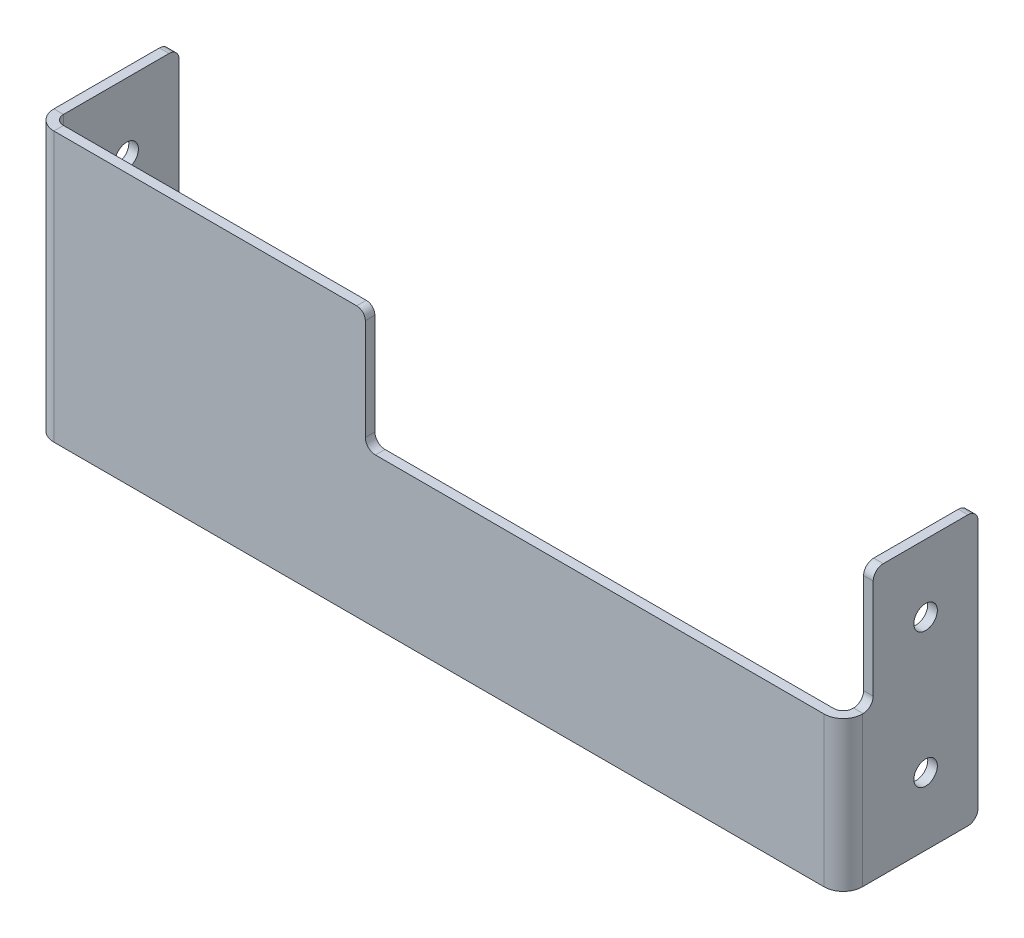
ISO-10303-21;
HEADER;
FILE_DESCRIPTION(('STEP AP214'),'2;1');
FILE_NAME('part.step','',(''),(''),'','','');
FILE_SCHEMA(('AUTOMOTIVE_DESIGN { 1 0 10303 214 1 1 1 1 }'));
ENDSEC;
DATA;
#1=APPLICATION_CONTEXT('core data for automotive mechanical design processes');
#2=APPLICATION_PROTOCOL_DEFINITION('international standard','automotive_design',2000,#1);
#3=PRODUCT_CONTEXT('',#1,'mechanical');
#4=PRODUCT('Part','Part','',(#3));
#5=PRODUCT_RELATED_PRODUCT_CATEGORY('part','',(#4));
#6=PRODUCT_DEFINITION_FORMATION('','',#4);
#7=PRODUCT_DEFINITION_CONTEXT('part definition',#1,'design');
#8=PRODUCT_DEFINITION('design','',#6,#7);
#9=PRODUCT_DEFINITION_SHAPE('','',#8);
#10=(LENGTH_UNIT() NAMED_UNIT(*) SI_UNIT(.MILLI.,.METRE.));
#11=(NAMED_UNIT(*) PLANE_ANGLE_UNIT() SI_UNIT($,.RADIAN.));
#12=(NAMED_UNIT(*) SI_UNIT($,.STERADIAN.) SOLID_ANGLE_UNIT());
#13=UNCERTAINTY_MEASURE_WITH_UNIT(LENGTH_MEASURE(1.E-05),#10,'distance_accuracy_value','');
#14=(GEOMETRIC_REPRESENTATION_CONTEXT(3) GLOBAL_UNCERTAINTY_ASSIGNED_CONTEXT((#13)) GLOBAL_UNIT_ASSIGNED_CONTEXT((#10,
#11,#12)) REPRESENTATION_CONTEXT('',''));
#15=CARTESIAN_POINT('',(0.,0.,0.));
#16=DIRECTION('',(0.,0.,1.));
#17=DIRECTION('',(1.,0.,0.));
#18=AXIS2_PLACEMENT_3D('',#15,#16,#17);
#19=CARTESIAN_POINT('',(-158.75,-25.5278986943512,16.7005000000141));
#20=DIRECTION('',(0.,-1.,0.));
#21=DIRECTION('',(0.,0.,-1.));
#22=AXIS2_PLACEMENT_3D('',#19,#20,#21);
#23=PLANE('',#22);
#24=DIRECTION('',(0.,0.,-1.));
#25=VECTOR('',#24,1.);
#26=CARTESIAN_POINT('',(-154.686,-25.5278986943512,16.7005000000141));
#27=LINE('',#26,#25);
#28=CARTESIAN_POINT('',(-154.686,-25.5278986943512,18.7325000000141));
#29=VERTEX_POINT('',#28);
#30=CARTESIAN_POINT('',(-154.686,-25.5278986943512,16.7005000000141));
#31=VERTEX_POINT('',#30);
#32=EDGE_CURVE('E288',#29,#31,#27,.T.);
#33=ORIENTED_EDGE('',*,*,#32,.T.);
#34=DIRECTION('',(-1.,0.,0.));
#35=VECTOR('',#34,1.);
#36=CARTESIAN_POINT('',(12.7,-25.5278986943512,16.7005000000141));
#37=LINE('',#36,#35);
#38=CARTESIAN_POINT('',(8.636,-25.5278986943512,16.7005000000141));
#39=VERTEX_POINT('',#38);
#40=EDGE_CURVE('E283',#39,#31,#37,.T.);
#41=ORIENTED_EDGE('',*,*,#40,.F.);
#42=DIRECTION('',(0.,0.,1.));
#43=VECTOR('',#42,1.);
#44=CARTESIAN_POINT('',(8.636,-25.5278986943512,16.7005000000141));
#45=LINE('',#44,#43);
#46=CARTESIAN_POINT('',(8.636,-25.5278986943512,18.7325000000141));
#47=VERTEX_POINT('',#46);
#48=EDGE_CURVE('E532',#39,#47,#45,.T.);
#49=ORIENTED_EDGE('',*,*,#48,.T.);
#50=DIRECTION('',(1.,0.,0.));
#51=VECTOR('',#50,1.);
#52=CARTESIAN_POINT('',(12.7,-25.5278986943512,18.7325000000141));
#53=LINE('',#52,#51);
#54=EDGE_CURVE('E348',#29,#47,#53,.T.);
#55=ORIENTED_EDGE('',*,*,#54,.F.);
#56=EDGE_LOOP('',(#33,#41,#49,#55));
#57=FACE_BOUND('',#56,.T.);
#58=ADVANCED_FACE('F50',(#57),#23,.T.);
#59=CARTESIAN_POINT('',(12.7,31.6221013056488,16.7005000000141));
#60=DIRECTION('',(0.,1.,0.));
#61=DIRECTION('',(1.,0.,0.));
#62=AXIS2_PLACEMENT_3D('',#59,#60,#61);
#63=PLANE('',#62);
#64=DIRECTION('',(-1.,0.,0.));
#65=VECTOR('',#64,1.);
#66=CARTESIAN_POINT('',(-158.75,31.6221013056488,18.7325000000141));
#67=LINE('',#66,#65);
#68=CARTESIAN_POINT('',(-90.469212,31.6221013056486,18.7325000000141));
#69=VERTEX_POINT('',#68);
#70=CARTESIAN_POINT('',(-154.686,31.6221013056488,18.7325000000141));
#71=VERTEX_POINT('',#70);
#72=EDGE_CURVE('E539',#69,#71,#67,.T.);
#73=ORIENTED_EDGE('',*,*,#72,.F.);
#74=DIRECTION('',(0.,0.,-1.));
#75=VECTOR('',#74,1.);
#76=CARTESIAN_POINT('',(-90.469212,31.6221013056486,57.5535238490692));
#77=LINE('',#76,#75);
#78=CARTESIAN_POINT('',(-90.469212,31.6221013056486,16.7005000000141));
#79=VERTEX_POINT('',#78);
#80=EDGE_CURVE('E227',#69,#79,#77,.T.);
#81=ORIENTED_EDGE('',*,*,#80,.T.);
#82=DIRECTION('',(1.,0.,0.));
#83=VECTOR('',#82,1.);
#84=CARTESIAN_POINT('',(-158.75,31.6221013056488,16.7005000000141));
#85=LINE('',#84,#83);
#86=CARTESIAN_POINT('',(-154.686,31.6221013056488,16.7005000000141));
#87=VERTEX_POINT('',#86);
#88=EDGE_CURVE('E562',#87,#79,#85,.T.);
#89=ORIENTED_EDGE('',*,*,#88,.F.);
#90=DIRECTION('',(0.,0.,1.));
#91=VECTOR('',#90,1.);
#92=CARTESIAN_POINT('',(-154.686,31.6221013056488,16.7005000000141));
#93=LINE('',#92,#91);
#94=EDGE_CURVE('E588',#87,#71,#93,.T.);
#95=ORIENTED_EDGE('',*,*,#94,.T.);
#96=EDGE_LOOP('',(#73,#81,#89,#95));
#97=FACE_BOUND('',#96,.T.);
#98=ADVANCED_FACE('F428',(#97),#63,.T.);
#99=CARTESIAN_POINT('',(12.7,3.0471013056488,4.7111378579681));
#100=DIRECTION('',(1.,0.,0.));
#101=DIRECTION('',(0.,0.,1.));
#102=AXIS2_PLACEMENT_3D('',#99,#100,#101);
#103=PLANE('',#102);
#104=CARTESIAN_POINT('',(12.7,17.3346013056489,1.2700000000141));
#105=DIRECTION('',(1.,0.,0.));
#106=DIRECTION('',(0.,0.,-1.));
#107=AXIS2_PLACEMENT_3D('',#104,#105,#106);
#108=CIRCLE('',#107,2.4892);
#109=CARTESIAN_POINT('',(12.7,17.3346013056489,-1.2191999999859));
#110=VERTEX_POINT('',#109);
#111=EDGE_CURVE('E246',#110,#110,#108,.T.);
#112=ORIENTED_EDGE('',*,*,#111,.F.);
#113=EDGE_LOOP('',(#112));
#114=FACE_BOUND('',#113,.T.);
#115=CARTESIAN_POINT('',(12.7,-11.2403986943513,1.2700000000141));
#116=DIRECTION('',(1.,0.,0.));
#117=DIRECTION('',(0.,0.,-1.));
#118=AXIS2_PLACEMENT_3D('',#115,#116,#117);
#119=CIRCLE('',#118,2.4892);
#120=CARTESIAN_POINT('',(12.7,-11.2403986943513,-1.2191999999859));
#121=VERTEX_POINT('',#120);
#122=EDGE_CURVE('E250',#121,#121,#119,.T.);
#123=ORIENTED_EDGE('',*,*,#122,.F.);
#124=EDGE_LOOP('',(#123));
#125=FACE_BOUND('',#124,.T.);
#126=DIRECTION('',(0.,0.,-1.));
#127=VECTOR('',#126,1.);
#128=CARTESIAN_POINT('',(12.7,-25.5278986943512,23.8610514318301));
#129=LINE('',#128,#127);
#130=CARTESIAN_POINT('',(12.7,-25.5278986943512,14.6685000000141));
#131=VERTEX_POINT('',#130);
#132=CARTESIAN_POINT('',(12.7,-25.5278986943512,-7.70737599998589));
#133=VERTEX_POINT('',#132);
#134=EDGE_CURVE('E534',#131,#133,#129,.T.);
#135=ORIENTED_EDGE('',*,*,#134,.T.);
#136=CARTESIAN_POINT('',(12.7,-23.3927746943512,-7.7073759999859));
#137=DIRECTION('',(1.,0.,0.));
#138=DIRECTION('',(0.,0.,-1.));
#139=AXIS2_PLACEMENT_3D('',#136,#137,#138);
#140=CIRCLE('',#139,2.135124);
#141=CARTESIAN_POINT('',(12.7,-23.3927746943512,-9.8424999999859));
#142=VERTEX_POINT('',#141);
#143=EDGE_CURVE('E377',#133,#142,#140,.T.);
#144=ORIENTED_EDGE('',*,*,#143,.T.);
#145=DIRECTION('',(0.,1.,0.));
#146=VECTOR('',#145,1.);
#147=CARTESIAN_POINT('',(12.7,31.6221013056488,-9.8424999999859));
#148=LINE('',#147,#146);
#149=CARTESIAN_POINT('',(12.7,29.4869773056488,-9.8424999999859));
#150=VERTEX_POINT('',#149);
#151=EDGE_CURVE('E294',#142,#150,#148,.T.);
#152=ORIENTED_EDGE('',*,*,#151,.T.);
#153=CARTESIAN_POINT('',(12.7,29.4869773056488,-7.7073759999859));
#154=DIRECTION('',(1.,0.,0.));
#155=DIRECTION('',(0.,0.,-1.));
#156=AXIS2_PLACEMENT_3D('',#153,#154,#155);
#157=CIRCLE('',#156,2.135124);
#158=CARTESIAN_POINT('',(12.7,31.6221013056488,-7.7073759999859));
#159=VERTEX_POINT('',#158);
#160=EDGE_CURVE('E375',#150,#159,#157,.T.);
#161=ORIENTED_EDGE('',*,*,#160,.T.);
#162=DIRECTION('',(0.,0.,1.));
#163=VECTOR('',#162,1.);
#164=CARTESIAN_POINT('',(12.7,31.6221013056488,14.6685000000141));
#165=LINE('',#164,#163);
#166=CARTESIAN_POINT('',(12.7,31.6221013056488,10.2473760000141));
#167=VERTEX_POINT('',#166);
#168=EDGE_CURVE('E290',#159,#167,#165,.T.);
#169=ORIENTED_EDGE('',*,*,#168,.T.);
#170=CARTESIAN_POINT('',(12.7,29.4869773056488,10.2473760000141));
#171=DIRECTION('',(1.,0.,0.));
#172=DIRECTION('',(0.,0.,-1.));
#173=AXIS2_PLACEMENT_3D('',#170,#171,#172);
#174=CIRCLE('',#173,2.135124);
#175=CARTESIAN_POINT('',(12.7,29.4869773056488,12.3825000000141));
#176=VERTEX_POINT('',#175);
#177=EDGE_CURVE('E373',#167,#176,#174,.T.);
#178=ORIENTED_EDGE('',*,*,#177,.T.);
#179=DIRECTION('',(0.,1.,0.));
#180=VECTOR('',#179,1.);
#181=CARTESIAN_POINT('',(12.7,31.6221013056488,12.3825000000141));
#182=LINE('',#181,#180);
#183=CARTESIAN_POINT('',(12.7,8.35722530564878,12.3825000000141));
#184=VERTEX_POINT('',#183);
#185=EDGE_CURVE('E271',#184,#176,#182,.T.);
#186=ORIENTED_EDGE('',*,*,#185,.F.);
#187=CARTESIAN_POINT('',(12.7,8.35722530564878,14.5176240000141));
#188=DIRECTION('',(1.,0.,0.));
#189=DIRECTION('',(0.,0.,-1.));
#190=AXIS2_PLACEMENT_3D('',#187,#188,#189);
#191=CIRCLE('',#190,2.135124);
#192=CARTESIAN_POINT('',(12.7,6.22210130564878,14.5176240000141));
#193=VERTEX_POINT('',#192);
#194=EDGE_CURVE('E59',#184,#193,#191,.F.);
#195=ORIENTED_EDGE('',*,*,#194,.T.);
#196=DIRECTION('',(0.,0.,-1.));
#197=VECTOR('',#196,1.);
#198=CARTESIAN_POINT('',(12.7,6.22210130564878,18.7325000000141));
#199=LINE('',#198,#197);
#200=CARTESIAN_POINT('',(12.7,6.22210130564878,14.6685000000141));
#201=VERTEX_POINT('',#200);
#202=EDGE_CURVE('E264',#201,#193,#199,.T.);
#203=ORIENTED_EDGE('',*,*,#202,.F.);
#204=DIRECTION('',(0.,-1.,0.));
#205=VECTOR('',#204,1.);
#206=CARTESIAN_POINT('',(12.7,3.0471013056488,14.6685000000141));
#207=LINE('',#206,#205);
#208=EDGE_CURVE('E564',#201,#131,#207,.T.);
#209=ORIENTED_EDGE('',*,*,#208,.T.);
#210=EDGE_LOOP('',(#135,#144,#152,#161,#169,#178,#186,#195,#203,#209));
#211=FACE_BOUND('',#210,.T.);
#212=ADVANCED_FACE('F435',(#114,#125,#211),#103,.T.);
#213=CARTESIAN_POINT('',(8.636,3.0471013056488,14.6685000000141));
#214=DIRECTION('',(0.,1.,0.));
#215=DIRECTION('',(0.,0.,1.));
#216=AXIS2_PLACEMENT_3D('',#213,#214,#215);
#217=CYLINDRICAL_SURFACE('',#216,2.032);
#218=DIRECTION('',(0.,-1.,0.));
#219=VECTOR('',#218,1.);
#220=CARTESIAN_POINT('',(8.636,17.3346013056488,16.7005000000141));
#221=LINE('',#220,#219);
#222=CARTESIAN_POINT('',(8.636,6.22210130564878,16.7005000000141));
#223=VERTEX_POINT('',#222);
#224=EDGE_CURVE('E281',#223,#39,#221,.T.);
#225=ORIENTED_EDGE('',*,*,#224,.F.);
#226=CARTESIAN_POINT('',(8.636,6.22210130564878,14.6685000000141));
#227=DIRECTION('',(0.,-1.,0.));
#228=DIRECTION('',(0.,0.,-1.));
#229=AXIS2_PLACEMENT_3D('',#226,#227,#228);
#230=CIRCLE('',#229,2.032);
#231=CARTESIAN_POINT('',(10.668,6.22210130564878,14.6685000000141));
#232=VERTEX_POINT('',#231);
#233=EDGE_CURVE('E267',#232,#223,#230,.T.);
#234=ORIENTED_EDGE('',*,*,#233,.F.);
#235=DIRECTION('',(0.,1.,0.));
#236=VECTOR('',#235,1.);
#237=CARTESIAN_POINT('',(10.668,3.0471013056488,14.6685000000141));
#238=LINE('',#237,#236);
#239=CARTESIAN_POINT('',(10.668,-25.5278986943512,14.6685000000141));
#240=VERTEX_POINT('',#239);
#241=EDGE_CURVE('E531',#240,#232,#238,.T.);
#242=ORIENTED_EDGE('',*,*,#241,.F.);
#243=CARTESIAN_POINT('',(8.636,-25.5278986943512,14.6685000000141));
#244=DIRECTION('',(0.,-1.,0.));
#245=DIRECTION('',(1.,0.,0.));
#246=AXIS2_PLACEMENT_3D('',#243,#244,#245);
#247=CIRCLE('',#246,2.032);
#248=EDGE_CURVE('E295',#240,#39,#247,.T.);
#249=ORIENTED_EDGE('',*,*,#248,.T.);
#250=EDGE_LOOP('',(#225,#234,#242,#249));
#251=FACE_BOUND('',#250,.T.);
#252=ADVANCED_FACE('F451',(#251),#217,.F.);
#253=CARTESIAN_POINT('',(10.668,-25.5278986943512,-9.8424999999859));
#254=DIRECTION('',(0.,0.,-1.));
#255=DIRECTION('',(0.,-1.,0.));
#256=AXIS2_PLACEMENT_3D('',#253,#254,#255);
#257=PLANE('',#256);
#258=ORIENTED_EDGE('',*,*,#151,.F.);
#259=DIRECTION('',(1.,0.,0.));
#260=VECTOR('',#259,1.);
#261=CARTESIAN_POINT('',(10.668,-23.3927746943512,-9.8424999999859));
#262=LINE('',#261,#260);
#263=CARTESIAN_POINT('',(10.668,-23.3927746943512,-9.8424999999859));
#264=VERTEX_POINT('',#263);
#265=EDGE_CURVE('E382',#142,#264,#262,.F.);
#266=ORIENTED_EDGE('',*,*,#265,.T.);
#267=DIRECTION('',(0.,-1.,0.));
#268=VECTOR('',#267,1.);
#269=CARTESIAN_POINT('',(10.668,31.6221013056488,-9.8424999999859));
#270=LINE('',#269,#268);
#271=CARTESIAN_POINT('',(10.668,29.4869773056488,-9.8424999999859));
#272=VERTEX_POINT('',#271);
#273=EDGE_CURVE('E530',#272,#264,#270,.T.);
#274=ORIENTED_EDGE('',*,*,#273,.F.);
#275=DIRECTION('',(1.,0.,0.));
#276=VECTOR('',#275,1.);
#277=CARTESIAN_POINT('',(10.668,29.4869773056488,-9.8424999999859));
#278=LINE('',#277,#276);
#279=EDGE_CURVE('E379',#272,#150,#278,.T.);
#280=ORIENTED_EDGE('',*,*,#279,.T.);
#281=EDGE_LOOP('',(#258,#266,#274,#280));
#282=FACE_BOUND('',#281,.T.);
#283=ADVANCED_FACE('F448',(#282),#257,.T.);
#284=CARTESIAN_POINT('',(10.668,31.6221013056488,-9.8424999999859));
#285=DIRECTION('',(0.,1.,0.));
#286=DIRECTION('',(1.,0.,0.));
#287=AXIS2_PLACEMENT_3D('',#284,#285,#286);
#288=PLANE('',#287);
#289=ORIENTED_EDGE('',*,*,#168,.F.);
#290=DIRECTION('',(1.,0.,0.));
#291=VECTOR('',#290,1.);
#292=CARTESIAN_POINT('',(10.668,31.6221013056488,-7.7073759999859));
#293=LINE('',#292,#291);
#294=CARTESIAN_POINT('',(10.668,31.6221013056488,-7.70737599998589));
#295=VERTEX_POINT('',#294);
#296=EDGE_CURVE('E393',#159,#295,#293,.F.);
#297=ORIENTED_EDGE('',*,*,#296,.T.);
#298=DIRECTION('',(0.,0.,1.));
#299=VECTOR('',#298,1.);
#300=CARTESIAN_POINT('',(10.668,31.6221013056488,23.8610514318301));
#301=LINE('',#300,#299);
#302=CARTESIAN_POINT('',(10.668,31.6221013056488,10.2473760000141));
#303=VERTEX_POINT('',#302);
#304=EDGE_CURVE('E526',#295,#303,#301,.T.);
#305=ORIENTED_EDGE('',*,*,#304,.T.);
#306=DIRECTION('',(1.,0.,0.));
#307=VECTOR('',#306,1.);
#308=CARTESIAN_POINT('',(12.7,31.6221013056488,10.2473760000141));
#309=LINE('',#308,#307);
#310=EDGE_CURVE('E390',#303,#167,#309,.T.);
#311=ORIENTED_EDGE('',*,*,#310,.T.);
#312=EDGE_LOOP('',(#289,#297,#305,#311));
#313=FACE_BOUND('',#312,.T.);
#314=ADVANCED_FACE('F446',(#313),#288,.T.);
#315=CARTESIAN_POINT('',(12.7,-25.5278986943512,14.6685000000141));
#316=DIRECTION('',(0.,-1.,0.));
#317=DIRECTION('',(0.,0.,-1.));
#318=AXIS2_PLACEMENT_3D('',#315,#316,#317);
#319=PLANE('',#318);
#320=DIRECTION('',(-1.,0.,0.));
#321=VECTOR('',#320,1.);
#322=CARTESIAN_POINT('',(11.11504,-25.5278986943512,14.6685000000141));
#323=LINE('',#322,#321);
#324=EDGE_CURVE('E339',#131,#240,#323,.T.);
#325=ORIENTED_EDGE('',*,*,#324,.F.);
#326=CARTESIAN_POINT('',(8.636,-25.5278986943512,14.6685000000141));
#327=DIRECTION('',(0.,1.,0.));
#328=DIRECTION('',(0.,0.,1.));
#329=AXIS2_PLACEMENT_3D('',#326,#327,#328);
#330=CIRCLE('',#329,4.064);
#331=EDGE_CURVE('E345',#47,#131,#330,.T.);
#332=ORIENTED_EDGE('',*,*,#331,.F.);
#333=ORIENTED_EDGE('',*,*,#48,.F.);
#334=ORIENTED_EDGE('',*,*,#248,.F.);
#335=EDGE_LOOP('',(#325,#332,#333,#334));
#336=FACE_BOUND('',#335,.T.);
#337=ADVANCED_FACE('F442',(#336),#319,.T.);
#338=CARTESIAN_POINT('',(10.668,3.0471013056488,4.7111378579681));
#339=DIRECTION('',(1.,0.,0.));
#340=DIRECTION('',(0.,1.,0.));
#341=AXIS2_PLACEMENT_3D('',#338,#339,#340);
#342=PLANE('',#341);
#343=CARTESIAN_POINT('',(10.668,17.3346013056489,1.2700000000141));
#344=DIRECTION('',(1.,0.,0.));
#345=DIRECTION('',(0.,1.,0.));
#346=AXIS2_PLACEMENT_3D('',#343,#344,#345);
#347=CIRCLE('',#346,2.4892);
#348=CARTESIAN_POINT('',(10.668,19.8238013056489,1.2700000000141));
#349=VERTEX_POINT('',#348);
#350=EDGE_CURVE('E261',#349,#349,#347,.T.);
#351=ORIENTED_EDGE('',*,*,#350,.T.);
#352=EDGE_LOOP('',(#351));
#353=FACE_BOUND('',#352,.T.);
#354=CARTESIAN_POINT('',(10.668,-11.2403986943513,1.2700000000141));
#355=DIRECTION('',(1.,0.,0.));
#356=DIRECTION('',(0.,1.,0.));
#357=AXIS2_PLACEMENT_3D('',#354,#355,#356);
#358=CIRCLE('',#357,2.4892);
#359=CARTESIAN_POINT('',(10.668,-8.75119869435134,1.2700000000141));
#360=VERTEX_POINT('',#359);
#361=EDGE_CURVE('E258',#360,#360,#358,.T.);
#362=ORIENTED_EDGE('',*,*,#361,.T.);
#363=EDGE_LOOP('',(#362));
#364=FACE_BOUND('',#363,.T.);
#365=ORIENTED_EDGE('',*,*,#273,.T.);
#366=CARTESIAN_POINT('',(10.668,-23.3927746943512,-7.7073759999859));
#367=DIRECTION('',(1.,0.,0.));
#368=DIRECTION('',(0.,1.,0.));
#369=AXIS2_PLACEMENT_3D('',#366,#367,#368);
#370=CIRCLE('',#369,2.135124);
#371=CARTESIAN_POINT('',(10.668,-25.5278986943512,-7.70737599998589));
#372=VERTEX_POINT('',#371);
#373=EDGE_CURVE('E388',#264,#372,#370,.F.);
#374=ORIENTED_EDGE('',*,*,#373,.T.);
#375=DIRECTION('',(0.,0.,1.));
#376=VECTOR('',#375,1.);
#377=CARTESIAN_POINT('',(10.668,-25.5278986943512,23.8610514318301));
#378=LINE('',#377,#376);
#379=EDGE_CURVE('E344',#372,#240,#378,.T.);
#380=ORIENTED_EDGE('',*,*,#379,.T.);
#381=ORIENTED_EDGE('',*,*,#241,.T.);
#382=DIRECTION('',(0.,0.,1.));
#383=VECTOR('',#382,1.);
#384=CARTESIAN_POINT('',(10.668,6.22210130564878,18.7325000000141));
#385=LINE('',#384,#383);
#386=CARTESIAN_POINT('',(10.668,6.22210130564878,14.5176240000141));
#387=VERTEX_POINT('',#386);
#388=EDGE_CURVE('E265',#387,#232,#385,.T.);
#389=ORIENTED_EDGE('',*,*,#388,.F.);
#390=CARTESIAN_POINT('',(10.668,8.35722530564878,14.5176240000141));
#391=DIRECTION('',(1.,0.,0.));
#392=DIRECTION('',(0.,1.,0.));
#393=AXIS2_PLACEMENT_3D('',#390,#391,#392);
#394=CIRCLE('',#393,2.135124);
#395=CARTESIAN_POINT('',(10.668,8.35722530564878,12.3825000000141));
#396=VERTEX_POINT('',#395);
#397=EDGE_CURVE('E12',#387,#396,#394,.T.);
#398=ORIENTED_EDGE('',*,*,#397,.T.);
#399=DIRECTION('',(0.,-1.,0.));
#400=VECTOR('',#399,1.);
#401=CARTESIAN_POINT('',(10.668,31.6221013056488,12.3825000000141));
#402=LINE('',#401,#400);
#403=CARTESIAN_POINT('',(10.668,29.4869773056488,12.3825000000141));
#404=VERTEX_POINT('',#403);
#405=EDGE_CURVE('E268',#404,#396,#402,.T.);
#406=ORIENTED_EDGE('',*,*,#405,.F.);
#407=CARTESIAN_POINT('',(10.668,29.4869773056488,10.2473760000141));
#408=DIRECTION('',(1.,0.,0.));
#409=DIRECTION('',(0.,1.,0.));
#410=AXIS2_PLACEMENT_3D('',#407,#408,#409);
#411=CIRCLE('',#410,2.135124);
#412=EDGE_CURVE('E384',#404,#303,#411,.F.);
#413=ORIENTED_EDGE('',*,*,#412,.T.);
#414=ORIENTED_EDGE('',*,*,#304,.F.);
#415=CARTESIAN_POINT('',(10.668,29.4869773056488,-7.7073759999859));
#416=DIRECTION('',(1.,0.,0.));
#417=DIRECTION('',(0.,1.,0.));
#418=AXIS2_PLACEMENT_3D('',#415,#416,#417);
#419=CIRCLE('',#418,2.135124);
#420=EDGE_CURVE('E386',#295,#272,#419,.F.);
#421=ORIENTED_EDGE('',*,*,#420,.T.);
#422=EDGE_LOOP('',(#365,#374,#380,#381,#389,#398,#406,#413,#414,#421));
#423=FACE_BOUND('',#422,.T.);
#424=ADVANCED_FACE('F445',(#353,#364,#423),#342,.F.);
#425=CARTESIAN_POINT('',(10.668,-25.5278986943512,19.2647757159221));
#426=DIRECTION('',(0.,-1.,0.));
#427=DIRECTION('',(0.,0.,-1.));
#428=AXIS2_PLACEMENT_3D('',#425,#426,#427);
#429=PLANE('',#428);
#430=ORIENTED_EDGE('',*,*,#379,.F.);
#431=DIRECTION('',(1.,0.,0.));
#432=VECTOR('',#431,1.);
#433=CARTESIAN_POINT('',(10.668,-25.5278986943512,-7.7073759999859));
#434=LINE('',#433,#432);
#435=EDGE_CURVE('E370',#372,#133,#434,.T.);
#436=ORIENTED_EDGE('',*,*,#435,.T.);
#437=ORIENTED_EDGE('',*,*,#134,.F.);
#438=ORIENTED_EDGE('',*,*,#324,.T.);
#439=EDGE_LOOP('',(#430,#436,#437,#438));
#440=FACE_BOUND('',#439,.T.);
#441=ADVANCED_FACE('F455',(#440),#429,.T.);
#442=CARTESIAN_POINT('',(8.636,3.0471013056488,14.6685000000141));
#443=DIRECTION('',(0.,1.,0.));
#444=DIRECTION('',(0.,0.,1.));
#445=AXIS2_PLACEMENT_3D('',#442,#443,#444);
#446=CYLINDRICAL_SURFACE('',#445,4.064);
#447=CARTESIAN_POINT('',(8.636,6.22210130564878,14.6685000000141));
#448=DIRECTION('',(0.,-1.,0.));
#449=DIRECTION('',(0.,0.,-1.));
#450=AXIS2_PLACEMENT_3D('',#447,#448,#449);
#451=CIRCLE('',#450,4.064);
#452=CARTESIAN_POINT('',(8.636,6.22210130564878,18.7325000000141));
#453=VERTEX_POINT('',#452);
#454=EDGE_CURVE('E274',#201,#453,#451,.T.);
#455=ORIENTED_EDGE('',*,*,#454,.T.);
#456=DIRECTION('',(0.,1.,0.));
#457=VECTOR('',#456,1.);
#458=CARTESIAN_POINT('',(8.636,17.3346013056488,18.7325000000141));
#459=LINE('',#458,#457);
#460=EDGE_CURVE('E284',#47,#453,#459,.T.);
#461=ORIENTED_EDGE('',*,*,#460,.F.);
#462=ORIENTED_EDGE('',*,*,#331,.T.);
#463=ORIENTED_EDGE('',*,*,#208,.F.);
#464=EDGE_LOOP('',(#455,#461,#462,#463));
#465=FACE_BOUND('',#464,.T.);
#466=ADVANCED_FACE('F440',(#465),#446,.T.);
#467=CARTESIAN_POINT('',(-158.75,3.0471013056488,4.71113785796813));
#468=DIRECTION('',(-1.,0.,0.));
#469=DIRECTION('',(0.,0.,1.));
#470=AXIS2_PLACEMENT_3D('',#467,#468,#469);
#471=PLANE('',#470);
#472=CARTESIAN_POINT('',(-158.75,17.3346013056489,1.2700000000141));
#473=DIRECTION('',(1.,0.,0.));
#474=DIRECTION('',(0.,0.,-1.));
#475=AXIS2_PLACEMENT_3D('',#472,#473,#474);
#476=CIRCLE('',#475,2.4892);
#477=CARTESIAN_POINT('',(-158.75,17.3346013056489,-1.2191999999859));
#478=VERTEX_POINT('',#477);
#479=EDGE_CURVE('E249',#478,#478,#476,.T.);
#480=ORIENTED_EDGE('',*,*,#479,.T.);
#481=EDGE_LOOP('',(#480));
#482=FACE_BOUND('',#481,.T.);
#483=CARTESIAN_POINT('',(-158.75,-11.2403986943513,1.2700000000141));
#484=DIRECTION('',(1.,0.,0.));
#485=DIRECTION('',(0.,0.,-1.));
#486=AXIS2_PLACEMENT_3D('',#483,#484,#485);
#487=CIRCLE('',#486,2.4892);
#488=CARTESIAN_POINT('',(-158.75,-11.2403986943513,-1.2191999999859));
#489=VERTEX_POINT('',#488);
#490=EDGE_CURVE('E241',#489,#489,#487,.T.);
#491=ORIENTED_EDGE('',*,*,#490,.T.);
#492=EDGE_LOOP('',(#491));
#493=FACE_BOUND('',#492,.T.);
#494=DIRECTION('',(0.,0.,-1.));
#495=VECTOR('',#494,1.);
#496=CARTESIAN_POINT('',(-158.75,31.6221013056488,23.8610514318301));
#497=LINE('',#496,#495);
#498=CARTESIAN_POINT('',(-158.75,31.6221013056488,14.6685000000141));
#499=VERTEX_POINT('',#498);
#500=CARTESIAN_POINT('',(-158.75,31.6221013056488,-7.70737599998588));
#501=VERTEX_POINT('',#500);
#502=EDGE_CURVE('E557',#499,#501,#497,.T.);
#503=ORIENTED_EDGE('',*,*,#502,.T.);
#504=CARTESIAN_POINT('',(-158.75,29.4869773056488,-7.70737599998588));
#505=DIRECTION('',(-1.,0.,0.));
#506=DIRECTION('',(0.,0.,1.));
#507=AXIS2_PLACEMENT_3D('',#504,#505,#506);
#508=CIRCLE('',#507,2.135124);
#509=CARTESIAN_POINT('',(-158.75,29.4869773056488,-9.84249999998588));
#510=VERTEX_POINT('',#509);
#511=EDGE_CURVE('E357',#501,#510,#508,.T.);
#512=ORIENTED_EDGE('',*,*,#511,.T.);
#513=DIRECTION('',(0.,-1.,0.));
#514=VECTOR('',#513,1.);
#515=CARTESIAN_POINT('',(-158.75,-25.5278986943512,-9.84249999998588));
#516=LINE('',#515,#514);
#517=CARTESIAN_POINT('',(-158.75,-23.3927746943512,-9.84249999998588));
#518=VERTEX_POINT('',#517);
#519=EDGE_CURVE('E569',#510,#518,#516,.T.);
#520=ORIENTED_EDGE('',*,*,#519,.T.);
#521=CARTESIAN_POINT('',(-158.75,-23.3927746943512,-7.70737599998588));
#522=DIRECTION('',(-1.,0.,0.));
#523=DIRECTION('',(0.,0.,1.));
#524=AXIS2_PLACEMENT_3D('',#521,#522,#523);
#525=CIRCLE('',#524,2.135124);
#526=CARTESIAN_POINT('',(-158.75,-25.5278986943512,-7.70737599998588));
#527=VERTEX_POINT('',#526);
#528=EDGE_CURVE('E355',#518,#527,#525,.T.);
#529=ORIENTED_EDGE('',*,*,#528,.T.);
#530=DIRECTION('',(0.,0.,1.));
#531=VECTOR('',#530,1.);
#532=CARTESIAN_POINT('',(-158.75,-25.5278986943512,14.6685000000141));
#533=LINE('',#532,#531);
#534=CARTESIAN_POINT('',(-158.75,-25.5278986943512,14.6685000000141));
#535=VERTEX_POINT('',#534);
#536=EDGE_CURVE('E604',#527,#535,#533,.T.);
#537=ORIENTED_EDGE('',*,*,#536,.T.);
#538=DIRECTION('',(0.,1.,0.));
#539=VECTOR('',#538,1.);
#540=CARTESIAN_POINT('',(-158.75,3.0471013056488,14.6685000000141));
#541=LINE('',#540,#539);
#542=EDGE_CURVE('E599',#535,#499,#541,.T.);
#543=ORIENTED_EDGE('',*,*,#542,.T.);
#544=EDGE_LOOP('',(#503,#512,#520,#529,#537,#543));
#545=FACE_BOUND('',#544,.T.);
#546=ADVANCED_FACE('F488',(#482,#493,#545),#471,.T.);
#547=CARTESIAN_POINT('',(-154.686,3.0471013056488,14.6685000000141));
#548=DIRECTION('',(0.,-1.,0.));
#549=DIRECTION('',(0.,0.,1.));
#550=AXIS2_PLACEMENT_3D('',#547,#548,#549);
#551=CYLINDRICAL_SURFACE('',#550,2.032);
#552=DIRECTION('',(0.,-1.,0.));
#553=VECTOR('',#552,1.);
#554=CARTESIAN_POINT('',(-156.718,3.0471013056488,14.6685000000141));
#555=LINE('',#554,#553);
#556=CARTESIAN_POINT('',(-156.718,31.6221013056488,14.6685000000141));
#557=VERTEX_POINT('',#556);
#558=CARTESIAN_POINT('',(-156.718,-25.5278986943512,14.6685000000141));
#559=VERTEX_POINT('',#558);
#560=EDGE_CURVE('E584',#557,#559,#555,.T.);
#561=ORIENTED_EDGE('',*,*,#560,.F.);
#562=CARTESIAN_POINT('',(-154.686,31.6221013056488,14.6685000000141));
#563=DIRECTION('',(0.,1.,0.));
#564=DIRECTION('',(-1.,0.,0.));
#565=AXIS2_PLACEMENT_3D('',#562,#563,#564);
#566=CIRCLE('',#565,2.032);
#567=EDGE_CURVE('E590',#557,#87,#566,.T.);
#568=ORIENTED_EDGE('',*,*,#567,.T.);
#569=DIRECTION('',(0.,1.,0.));
#570=VECTOR('',#569,1.);
#571=CARTESIAN_POINT('',(-154.686,-11.2403986943512,16.7005000000141));
#572=LINE('',#571,#570);
#573=EDGE_CURVE('E559',#31,#87,#572,.T.);
#574=ORIENTED_EDGE('',*,*,#573,.F.);
#575=CARTESIAN_POINT('',(-154.686,-25.5278986943512,14.6685000000141));
#576=DIRECTION('',(0.,1.,0.));
#577=DIRECTION('',(-1.,0.,0.));
#578=AXIS2_PLACEMENT_3D('',#575,#576,#577);
#579=CIRCLE('',#578,2.032);
#580=EDGE_CURVE('E285',#559,#31,#579,.T.);
#581=ORIENTED_EDGE('',*,*,#580,.F.);
#582=EDGE_LOOP('',(#561,#568,#574,#581));
#583=FACE_BOUND('',#582,.T.);
#584=ADVANCED_FACE('F461',(#583),#551,.F.);
#585=CARTESIAN_POINT('',(-156.718,31.6221013056488,-9.84249999998588));
#586=DIRECTION('',(0.,0.,-1.));
#587=DIRECTION('',(0.,-1.,0.));
#588=AXIS2_PLACEMENT_3D('',#585,#586,#587);
#589=PLANE('',#588);
#590=ORIENTED_EDGE('',*,*,#519,.F.);
#591=DIRECTION('',(-1.,0.,0.));
#592=VECTOR('',#591,1.);
#593=CARTESIAN_POINT('',(-156.718,29.4869773056488,-9.84249999998588));
#594=LINE('',#593,#592);
#595=CARTESIAN_POINT('',(-156.718,29.4869773056488,-9.84249999998588));
#596=VERTEX_POINT('',#595);
#597=EDGE_CURVE('E362',#510,#596,#594,.F.);
#598=ORIENTED_EDGE('',*,*,#597,.T.);
#599=DIRECTION('',(0.,1.,0.));
#600=VECTOR('',#599,1.);
#601=CARTESIAN_POINT('',(-156.718,-25.5278986943512,-9.84249999998588));
#602=LINE('',#601,#600);
#603=CARTESIAN_POINT('',(-156.718,-23.3927746943512,-9.84249999998588));
#604=VERTEX_POINT('',#603);
#605=EDGE_CURVE('E591',#604,#596,#602,.T.);
#606=ORIENTED_EDGE('',*,*,#605,.F.);
#607=DIRECTION('',(-1.,0.,0.));
#608=VECTOR('',#607,1.);
#609=CARTESIAN_POINT('',(-156.718,-23.3927746943512,-9.84249999998588));
#610=LINE('',#609,#608);
#611=EDGE_CURVE('E359',#604,#518,#610,.T.);
#612=ORIENTED_EDGE('',*,*,#611,.T.);
#613=EDGE_LOOP('',(#590,#598,#606,#612));
#614=FACE_BOUND('',#613,.T.);
#615=ADVANCED_FACE('F457',(#614),#589,.T.);
#616=CARTESIAN_POINT('',(-156.718,-25.5278986943512,-9.84249999998588));
#617=DIRECTION('',(0.,-1.,0.));
#618=DIRECTION('',(0.,0.,-1.));
#619=AXIS2_PLACEMENT_3D('',#616,#617,#618);
#620=PLANE('',#619);
#621=ORIENTED_EDGE('',*,*,#536,.F.);
#622=DIRECTION('',(-1.,0.,0.));
#623=VECTOR('',#622,1.);
#624=CARTESIAN_POINT('',(-156.718,-25.5278986943512,-7.70737599998588));
#625=LINE('',#624,#623);
#626=CARTESIAN_POINT('',(-156.718,-25.5278986943512,-7.70737599998587));
#627=VERTEX_POINT('',#626);
#628=EDGE_CURVE('E368',#527,#627,#625,.F.);
#629=ORIENTED_EDGE('',*,*,#628,.T.);
#630=DIRECTION('',(0.,0.,1.));
#631=VECTOR('',#630,1.);
#632=CARTESIAN_POINT('',(-156.718,-25.5278986943512,23.8610514318301));
#633=LINE('',#632,#631);
#634=EDGE_CURVE('E587',#627,#559,#633,.T.);
#635=ORIENTED_EDGE('',*,*,#634,.T.);
#636=DIRECTION('',(-1.,0.,0.));
#637=VECTOR('',#636,1.);
#638=CARTESIAN_POINT('',(-157.16504,-25.5278986943512,14.6685000000141));
#639=LINE('',#638,#637);
#640=EDGE_CURVE('E289',#559,#535,#639,.T.);
#641=ORIENTED_EDGE('',*,*,#640,.T.);
#642=EDGE_LOOP('',(#621,#629,#635,#641));
#643=FACE_BOUND('',#642,.T.);
#644=ADVANCED_FACE('F460',(#643),#620,.T.);
#645=CARTESIAN_POINT('',(-158.75,31.6221013056488,14.6685000000141));
#646=DIRECTION('',(0.,1.,0.));
#647=DIRECTION('',(0.,0.,-1.));
#648=AXIS2_PLACEMENT_3D('',#645,#646,#647);
#649=PLANE('',#648);
#650=DIRECTION('',(1.,0.,0.));
#651=VECTOR('',#650,1.);
#652=CARTESIAN_POINT('',(-157.16504,31.6221013056488,14.6685000000141));
#653=LINE('',#652,#651);
#654=EDGE_CURVE('E558',#499,#557,#653,.T.);
#655=ORIENTED_EDGE('',*,*,#654,.F.);
#656=CARTESIAN_POINT('',(-154.686,31.6221013056488,14.6685000000141));
#657=DIRECTION('',(0.,-1.,0.));
#658=DIRECTION('',(0.,0.,1.));
#659=AXIS2_PLACEMENT_3D('',#656,#657,#658);
#660=CIRCLE('',#659,4.064);
#661=EDGE_CURVE('E346',#71,#499,#660,.T.);
#662=ORIENTED_EDGE('',*,*,#661,.F.);
#663=ORIENTED_EDGE('',*,*,#94,.F.);
#664=ORIENTED_EDGE('',*,*,#567,.F.);
#665=EDGE_LOOP('',(#655,#662,#663,#664));
#666=FACE_BOUND('',#665,.T.);
#667=ADVANCED_FACE('F479',(#666),#649,.T.);
#668=CARTESIAN_POINT('',(-156.718,-25.5278986943512,14.6685000000141));
#669=DIRECTION('',(0.,-1.,0.));
#670=DIRECTION('',(-1.,0.,0.));
#671=AXIS2_PLACEMENT_3D('',#668,#669,#670);
#672=PLANE('',#671);
#673=ORIENTED_EDGE('',*,*,#640,.F.);
#674=ORIENTED_EDGE('',*,*,#580,.T.);
#675=ORIENTED_EDGE('',*,*,#32,.F.);
#676=CARTESIAN_POINT('',(-154.686,-25.5278986943512,14.6685000000141));
#677=DIRECTION('',(0.,1.,0.));
#678=DIRECTION('',(-1.,0.,0.));
#679=AXIS2_PLACEMENT_3D('',#676,#677,#678);
#680=CIRCLE('',#679,4.064);
#681=EDGE_CURVE('E570',#535,#29,#680,.T.);
#682=ORIENTED_EDGE('',*,*,#681,.F.);
#683=EDGE_LOOP('',(#673,#674,#675,#682));
#684=FACE_BOUND('',#683,.T.);
#685=ADVANCED_FACE('F466',(#684),#672,.T.);
#686=CARTESIAN_POINT('',(-156.718,3.0471013056488,4.71113785796813));
#687=DIRECTION('',(-1.,0.,0.));
#688=DIRECTION('',(0.,0.,1.));
#689=AXIS2_PLACEMENT_3D('',#686,#687,#688);
#690=PLANE('',#689);
#691=CARTESIAN_POINT('',(-156.718,17.3346013056489,1.2700000000141));
#692=DIRECTION('',(-1.,0.,0.));
#693=DIRECTION('',(0.,0.,1.));
#694=AXIS2_PLACEMENT_3D('',#691,#692,#693);
#695=CIRCLE('',#694,2.4892);
#696=CARTESIAN_POINT('',(-156.718,17.3346013056489,3.7592000000141));
#697=VERTEX_POINT('',#696);
#698=EDGE_CURVE('E54',#697,#697,#695,.T.);
#699=ORIENTED_EDGE('',*,*,#698,.T.);
#700=EDGE_LOOP('',(#699));
#701=FACE_BOUND('',#700,.T.);
#702=CARTESIAN_POINT('',(-156.718,-11.2403986943513,1.2700000000141));
#703=DIRECTION('',(-1.,0.,0.));
#704=DIRECTION('',(0.,0.,1.));
#705=AXIS2_PLACEMENT_3D('',#702,#703,#704);
#706=CIRCLE('',#705,2.4892);
#707=CARTESIAN_POINT('',(-156.718,-11.2403986943513,3.7592000000141));
#708=VERTEX_POINT('',#707);
#709=EDGE_CURVE('E253',#708,#708,#706,.T.);
#710=ORIENTED_EDGE('',*,*,#709,.T.);
#711=EDGE_LOOP('',(#710));
#712=FACE_BOUND('',#711,.T.);
#713=ORIENTED_EDGE('',*,*,#605,.T.);
#714=CARTESIAN_POINT('',(-156.718,29.4869773056488,-7.70737599998588));
#715=DIRECTION('',(-1.,0.,0.));
#716=DIRECTION('',(0.,0.,1.));
#717=AXIS2_PLACEMENT_3D('',#714,#715,#716);
#718=CIRCLE('',#717,2.135124);
#719=CARTESIAN_POINT('',(-156.718,31.6221013056488,-7.70737599998588));
#720=VERTEX_POINT('',#719);
#721=EDGE_CURVE('E366',#596,#720,#718,.F.);
#722=ORIENTED_EDGE('',*,*,#721,.T.);
#723=DIRECTION('',(0.,0.,1.));
#724=VECTOR('',#723,1.);
#725=CARTESIAN_POINT('',(-156.718,31.6221013056488,23.8610514318301));
#726=LINE('',#725,#724);
#727=EDGE_CURVE('E553',#720,#557,#726,.T.);
#728=ORIENTED_EDGE('',*,*,#727,.T.);
#729=ORIENTED_EDGE('',*,*,#560,.T.);
#730=ORIENTED_EDGE('',*,*,#634,.F.);
#731=CARTESIAN_POINT('',(-156.718,-23.3927746943512,-7.70737599998588));
#732=DIRECTION('',(-1.,0.,0.));
#733=DIRECTION('',(0.,0.,1.));
#734=AXIS2_PLACEMENT_3D('',#731,#732,#733);
#735=CIRCLE('',#734,2.135124);
#736=EDGE_CURVE('E364',#627,#604,#735,.F.);
#737=ORIENTED_EDGE('',*,*,#736,.T.);
#738=EDGE_LOOP('',(#713,#722,#728,#729,#730,#737));
#739=FACE_BOUND('',#738,.T.);
#740=ADVANCED_FACE('F405',(#701,#712,#739),#690,.F.);
#741=CARTESIAN_POINT('',(-156.718,31.6221013056488,19.2647757159221));
#742=DIRECTION('',(0.,1.,0.));
#743=DIRECTION('',(0.,0.,-1.));
#744=AXIS2_PLACEMENT_3D('',#741,#742,#743);
#745=PLANE('',#744);
#746=ORIENTED_EDGE('',*,*,#727,.F.);
#747=DIRECTION('',(-1.,0.,0.));
#748=VECTOR('',#747,1.);
#749=CARTESIAN_POINT('',(-156.718,31.6221013056488,-7.70737599998588));
#750=LINE('',#749,#748);
#751=EDGE_CURVE('E352',#720,#501,#750,.T.);
#752=ORIENTED_EDGE('',*,*,#751,.T.);
#753=ORIENTED_EDGE('',*,*,#502,.F.);
#754=ORIENTED_EDGE('',*,*,#654,.T.);
#755=EDGE_LOOP('',(#746,#752,#753,#754));
#756=FACE_BOUND('',#755,.T.);
#757=ADVANCED_FACE('F465',(#756),#745,.T.);
#758=CARTESIAN_POINT('',(-154.686,3.0471013056488,14.6685000000141));
#759=DIRECTION('',(0.,-1.,0.));
#760=DIRECTION('',(0.,0.,1.));
#761=AXIS2_PLACEMENT_3D('',#758,#759,#760);
#762=CYLINDRICAL_SURFACE('',#761,4.064);
#763=ORIENTED_EDGE('',*,*,#542,.F.);
#764=ORIENTED_EDGE('',*,*,#681,.T.);
#765=DIRECTION('',(0.,-1.,0.));
#766=VECTOR('',#765,1.);
#767=CARTESIAN_POINT('',(-154.686,-11.2403986943512,18.7325000000141));
#768=LINE('',#767,#766);
#769=EDGE_CURVE('E351',#71,#29,#768,.T.);
#770=ORIENTED_EDGE('',*,*,#769,.F.);
#771=ORIENTED_EDGE('',*,*,#661,.T.);
#772=EDGE_LOOP('',(#763,#764,#770,#771));
#773=FACE_BOUND('',#772,.T.);
#774=ADVANCED_FACE('F475',(#773),#762,.T.);
#775=CARTESIAN_POINT('',(-73.025,3.0471013056488,16.7005000000141));
#776=DIRECTION('',(0.,0.,-1.));
#777=DIRECTION('',(0.,-1.,0.));
#778=AXIS2_PLACEMENT_3D('',#775,#776,#777);
#779=PLANE('',#778);
#780=ORIENTED_EDGE('',*,*,#88,.T.);
#781=CARTESIAN_POINT('',(-90.469212,29.7988893056486,16.7005000000141));
#782=DIRECTION('',(0.,0.,-1.));
#783=DIRECTION('',(0.,1.,0.));
#784=AXIS2_PLACEMENT_3D('',#781,#782,#783);
#785=CIRCLE('',#784,1.823212);
#786=CARTESIAN_POINT('',(-88.646,29.7988893056486,16.7005000000141));
#787=VERTEX_POINT('',#786);
#788=EDGE_CURVE('E231',#79,#787,#785,.T.);
#789=ORIENTED_EDGE('',*,*,#788,.T.);
#790=DIRECTION('',(0.,-1.,0.));
#791=VECTOR('',#790,1.);
#792=CARTESIAN_POINT('',(-88.646,29.7988893056486,16.7005000000141));
#793=LINE('',#792,#791);
#794=CARTESIAN_POINT('',(-88.646,8.3572253056486,16.7005000000141));
#795=VERTEX_POINT('',#794);
#796=EDGE_CURVE('E216',#787,#795,#793,.T.);
#797=ORIENTED_EDGE('',*,*,#796,.T.);
#798=CARTESIAN_POINT('',(-86.510876,8.3572253056486,16.7005000000141));
#799=DIRECTION('',(0.,0.,1.));
#800=DIRECTION('',(0.,1.,0.));
#801=AXIS2_PLACEMENT_3D('',#798,#799,#800);
#802=CIRCLE('',#801,2.13512399999999);
#803=CARTESIAN_POINT('',(-86.510876,6.22210130564878,16.7005000000141));
#804=VERTEX_POINT('',#803);
#805=EDGE_CURVE('E224',#795,#804,#802,.T.);
#806=ORIENTED_EDGE('',*,*,#805,.T.);
#807=DIRECTION('',(1.,0.,0.));
#808=VECTOR('',#807,1.);
#809=CARTESIAN_POINT('',(-36.6395,6.22210130564878,16.7005000000141));
#810=LINE('',#809,#808);
#811=EDGE_CURVE('E72',#804,#223,#810,.T.);
#812=ORIENTED_EDGE('',*,*,#811,.T.);
#813=ORIENTED_EDGE('',*,*,#224,.T.);
#814=ORIENTED_EDGE('',*,*,#40,.T.);
#815=ORIENTED_EDGE('',*,*,#573,.T.);
#816=EDGE_LOOP('',(#780,#789,#797,#806,#812,#813,#814,#815));
#817=FACE_BOUND('',#816,.T.);
#818=ADVANCED_FACE('F229',(#817),#779,.T.);
#819=CARTESIAN_POINT('',(-73.025,3.0471013056488,18.7325000000141));
#820=DIRECTION('',(0.,0.,1.));
#821=DIRECTION('',(1.,0.,0.));
#822=AXIS2_PLACEMENT_3D('',#819,#820,#821);
#823=PLANE('',#822);
#824=ORIENTED_EDGE('',*,*,#460,.T.);
#825=DIRECTION('',(-1.,0.,0.));
#826=VECTOR('',#825,1.);
#827=CARTESIAN_POINT('',(-36.6395,6.22210130564878,18.7325000000141));
#828=LINE('',#827,#826);
#829=CARTESIAN_POINT('',(-86.510876,6.22210130564878,18.7325000000141));
#830=VERTEX_POINT('',#829);
#831=EDGE_CURVE('E270',#453,#830,#828,.T.);
#832=ORIENTED_EDGE('',*,*,#831,.T.);
#833=CARTESIAN_POINT('',(-86.510876,8.3572253056486,18.7325000000141));
#834=DIRECTION('',(0.,0.,1.));
#835=DIRECTION('',(1.,0.,0.));
#836=AXIS2_PLACEMENT_3D('',#833,#834,#835);
#837=CIRCLE('',#836,2.13512399999999);
#838=CARTESIAN_POINT('',(-88.646,8.35722530564861,18.7325000000141));
#839=VERTEX_POINT('',#838);
#840=EDGE_CURVE('E221',#839,#830,#837,.T.);
#841=ORIENTED_EDGE('',*,*,#840,.F.);
#842=DIRECTION('',(0.,-1.,0.));
#843=VECTOR('',#842,1.);
#844=CARTESIAN_POINT('',(-88.646,29.7988893056486,18.7325000000141));
#845=LINE('',#844,#843);
#846=CARTESIAN_POINT('',(-88.646,29.7988893056486,18.7325000000141));
#847=VERTEX_POINT('',#846);
#848=EDGE_CURVE('E218',#847,#839,#845,.T.);
#849=ORIENTED_EDGE('',*,*,#848,.F.);
#850=CARTESIAN_POINT('',(-90.469212,29.7988893056486,18.7325000000141));
#851=DIRECTION('',(0.,0.,1.));
#852=DIRECTION('',(1.,0.,0.));
#853=AXIS2_PLACEMENT_3D('',#850,#851,#852);
#854=CIRCLE('',#853,1.823212);
#855=EDGE_CURVE('E238',#69,#847,#854,.F.);
#856=ORIENTED_EDGE('',*,*,#855,.F.);
#857=ORIENTED_EDGE('',*,*,#72,.T.);
#858=ORIENTED_EDGE('',*,*,#769,.T.);
#859=ORIENTED_EDGE('',*,*,#54,.T.);
#860=EDGE_LOOP('',(#824,#832,#841,#849,#856,#857,#858,#859));
#861=FACE_BOUND('',#860,.T.);
#862=ADVANCED_FACE('F472',(#861),#823,.T.);
#863=CARTESIAN_POINT('',(-0.254,6.22210130564878,18.7325000000141));
#864=DIRECTION('',(0.,-1.,0.));
#865=DIRECTION('',(0.,0.,-1.));
#866=AXIS2_PLACEMENT_3D('',#863,#864,#865);
#867=PLANE('',#866);
#868=ORIENTED_EDGE('',*,*,#811,.F.);
#869=DIRECTION('',(0.,0.,-1.));
#870=VECTOR('',#869,1.);
#871=CARTESIAN_POINT('',(-86.510876,6.22210130564861,57.5535238490692));
#872=LINE('',#871,#870);
#873=EDGE_CURVE('E67',#830,#804,#872,.T.);
#874=ORIENTED_EDGE('',*,*,#873,.F.);
#875=ORIENTED_EDGE('',*,*,#831,.F.);
#876=ORIENTED_EDGE('',*,*,#454,.F.);
#877=ORIENTED_EDGE('',*,*,#202,.T.);
#878=DIRECTION('',(1.,0.,0.));
#879=VECTOR('',#878,1.);
#880=CARTESIAN_POINT('',(10.668,6.22210130564878,14.5176240000141));
#881=LINE('',#880,#879);
#882=EDGE_CURVE('E400',#193,#387,#881,.F.);
#883=ORIENTED_EDGE('',*,*,#882,.T.);
#884=ORIENTED_EDGE('',*,*,#388,.T.);
#885=ORIENTED_EDGE('',*,*,#233,.T.);
#886=EDGE_LOOP('',(#868,#874,#875,#876,#877,#883,#884,#885));
#887=FACE_BOUND('',#886,.T.);
#888=ADVANCED_FACE('F468',(#887),#867,.F.);
#889=CARTESIAN_POINT('',(-158.751,31.6221013056488,12.3825000000141));
#890=DIRECTION('',(0.,0.,-1.));
#891=DIRECTION('',(0.,1.,0.));
#892=AXIS2_PLACEMENT_3D('',#889,#890,#891);
#893=PLANE('',#892);
#894=ORIENTED_EDGE('',*,*,#185,.T.);
#895=DIRECTION('',(1.,0.,0.));
#896=VECTOR('',#895,1.);
#897=CARTESIAN_POINT('',(10.668,29.4869773056488,12.3825000000141));
#898=LINE('',#897,#896);
#899=EDGE_CURVE('E398',#176,#404,#898,.F.);
#900=ORIENTED_EDGE('',*,*,#899,.T.);
#901=ORIENTED_EDGE('',*,*,#405,.T.);
#902=DIRECTION('',(1.,0.,0.));
#903=VECTOR('',#902,1.);
#904=CARTESIAN_POINT('',(12.7,8.35722530564878,12.3825000000141));
#905=LINE('',#904,#903);
#906=EDGE_CURVE('E395',#396,#184,#905,.T.);
#907=ORIENTED_EDGE('',*,*,#906,.T.);
#908=EDGE_LOOP('',(#894,#900,#901,#907));
#909=FACE_BOUND('',#908,.T.);
#910=ADVANCED_FACE('F471',(#909),#893,.F.);
#911=CARTESIAN_POINT('',(-156.718,29.4869773056488,-7.70737599998588));
#912=DIRECTION('',(-1.,0.,0.));
#913=DIRECTION('',(0.,0.,1.));
#914=AXIS2_PLACEMENT_3D('',#911,#912,#913);
#915=CYLINDRICAL_SURFACE('',#914,2.135124);
#916=ORIENTED_EDGE('',*,*,#721,.F.);
#917=ORIENTED_EDGE('',*,*,#597,.F.);
#918=ORIENTED_EDGE('',*,*,#511,.F.);
#919=ORIENTED_EDGE('',*,*,#751,.F.);
#920=EDGE_LOOP('',(#916,#917,#918,#919));
#921=FACE_BOUND('',#920,.T.);
#922=ADVANCED_FACE('F499',(#921),#915,.T.);
#923=CARTESIAN_POINT('',(-156.718,-23.3927746943512,-7.70737599998588));
#924=DIRECTION('',(-1.,0.,0.));
#925=DIRECTION('',(0.,0.,1.));
#926=AXIS2_PLACEMENT_3D('',#923,#924,#925);
#927=CYLINDRICAL_SURFACE('',#926,2.135124);
#928=ORIENTED_EDGE('',*,*,#736,.F.);
#929=ORIENTED_EDGE('',*,*,#628,.F.);
#930=ORIENTED_EDGE('',*,*,#528,.F.);
#931=ORIENTED_EDGE('',*,*,#611,.F.);
#932=EDGE_LOOP('',(#928,#929,#930,#931));
#933=FACE_BOUND('',#932,.T.);
#934=ADVANCED_FACE('F502',(#933),#927,.T.);
#935=CARTESIAN_POINT('',(10.668,-23.3927746943512,-7.7073759999859));
#936=DIRECTION('',(1.,0.,0.));
#937=DIRECTION('',(0.,0.,-1.));
#938=AXIS2_PLACEMENT_3D('',#935,#936,#937);
#939=CYLINDRICAL_SURFACE('',#938,2.135124);
#940=ORIENTED_EDGE('',*,*,#373,.F.);
#941=ORIENTED_EDGE('',*,*,#265,.F.);
#942=ORIENTED_EDGE('',*,*,#143,.F.);
#943=ORIENTED_EDGE('',*,*,#435,.F.);
#944=EDGE_LOOP('',(#940,#941,#942,#943));
#945=FACE_BOUND('',#944,.T.);
#946=ADVANCED_FACE('F506',(#945),#939,.T.);
#947=CARTESIAN_POINT('',(10.668,29.4869773056488,-7.7073759999859));
#948=DIRECTION('',(1.,0.,0.));
#949=DIRECTION('',(0.,0.,-1.));
#950=AXIS2_PLACEMENT_3D('',#947,#948,#949);
#951=CYLINDRICAL_SURFACE('',#950,2.135124);
#952=ORIENTED_EDGE('',*,*,#420,.F.);
#953=ORIENTED_EDGE('',*,*,#296,.F.);
#954=ORIENTED_EDGE('',*,*,#160,.F.);
#955=ORIENTED_EDGE('',*,*,#279,.F.);
#956=EDGE_LOOP('',(#952,#953,#954,#955));
#957=FACE_BOUND('',#956,.T.);
#958=ADVANCED_FACE('F510',(#957),#951,.T.);
#959=CARTESIAN_POINT('',(10.668,29.4869773056488,10.2473760000141));
#960=DIRECTION('',(-1.,0.,0.));
#961=DIRECTION('',(0.,0.,1.));
#962=AXIS2_PLACEMENT_3D('',#959,#960,#961);
#963=CYLINDRICAL_SURFACE('',#962,2.135124);
#964=ORIENTED_EDGE('',*,*,#412,.F.);
#965=ORIENTED_EDGE('',*,*,#899,.F.);
#966=ORIENTED_EDGE('',*,*,#177,.F.);
#967=ORIENTED_EDGE('',*,*,#310,.F.);
#968=EDGE_LOOP('',(#964,#965,#966,#967));
#969=FACE_BOUND('',#968,.T.);
#970=ADVANCED_FACE('F421',(#969),#963,.T.);
#971=CARTESIAN_POINT('',(-158.751,8.35722530564878,14.5176240000141));
#972=DIRECTION('',(-1.,0.,0.));
#973=DIRECTION('',(0.,0.,1.));
#974=AXIS2_PLACEMENT_3D('',#971,#972,#973);
#975=CYLINDRICAL_SURFACE('',#974,2.135124);
#976=ORIENTED_EDGE('',*,*,#397,.F.);
#977=ORIENTED_EDGE('',*,*,#882,.F.);
#978=ORIENTED_EDGE('',*,*,#194,.F.);
#979=ORIENTED_EDGE('',*,*,#906,.F.);
#980=EDGE_LOOP('',(#976,#977,#978,#979));
#981=FACE_BOUND('',#980,.T.);
#982=ADVANCED_FACE('F52',(#981),#975,.F.);
#983=CARTESIAN_POINT('',(-158.75,-11.2403986943513,1.2700000000141));
#984=DIRECTION('',(1.,0.,0.));
#985=DIRECTION('',(0.,0.,-1.));
#986=AXIS2_PLACEMENT_3D('',#983,#984,#985);
#987=CYLINDRICAL_SURFACE('',#986,2.4892);
#988=ORIENTED_EDGE('',*,*,#490,.F.);
#989=EDGE_LOOP('',(#988));
#990=FACE_BOUND('',#989,.T.);
#991=ORIENTED_EDGE('',*,*,#709,.F.);
#992=EDGE_LOOP('',(#991));
#993=FACE_BOUND('',#992,.T.);
#994=ADVANCED_FACE('F408',(#990,#993),#987,.F.);
#995=CARTESIAN_POINT('',(-158.75,17.3346013056489,1.2700000000141));
#996=DIRECTION('',(1.,0.,0.));
#997=DIRECTION('',(0.,0.,-1.));
#998=AXIS2_PLACEMENT_3D('',#995,#996,#997);
#999=CYLINDRICAL_SURFACE('',#998,2.4892);
#1000=ORIENTED_EDGE('',*,*,#479,.F.);
#1001=EDGE_LOOP('',(#1000));
#1002=FACE_BOUND('',#1001,.T.);
#1003=ORIENTED_EDGE('',*,*,#698,.F.);
#1004=EDGE_LOOP('',(#1003));
#1005=FACE_BOUND('',#1004,.T.);
#1006=ADVANCED_FACE('F410',(#1002,#1005),#999,.F.);
#1007=ORIENTED_EDGE('',*,*,#122,.T.);
#1008=EDGE_LOOP('',(#1007));
#1009=FACE_BOUND('',#1008,.T.);
#1010=ORIENTED_EDGE('',*,*,#361,.F.);
#1011=EDGE_LOOP('',(#1010));
#1012=FACE_BOUND('',#1011,.T.);
#1013=ADVANCED_FACE('F413',(#1009,#1012),#987,.F.);
#1014=ORIENTED_EDGE('',*,*,#111,.T.);
#1015=EDGE_LOOP('',(#1014));
#1016=FACE_BOUND('',#1015,.T.);
#1017=ORIENTED_EDGE('',*,*,#350,.F.);
#1018=EDGE_LOOP('',(#1017));
#1019=FACE_BOUND('',#1018,.T.);
#1020=ADVANCED_FACE('F420',(#1016,#1019),#999,.F.);
#1021=CARTESIAN_POINT('',(-90.469212,29.7988893056486,57.5535238490692));
#1022=DIRECTION('',(0.,0.,-1.));
#1023=DIRECTION('',(0.,1.,0.));
#1024=AXIS2_PLACEMENT_3D('',#1021,#1022,#1023);
#1025=CYLINDRICAL_SURFACE('',#1024,1.823212);
#1026=ORIENTED_EDGE('',*,*,#80,.F.);
#1027=ORIENTED_EDGE('',*,*,#855,.T.);
#1028=DIRECTION('',(0.,0.,-1.));
#1029=VECTOR('',#1028,1.);
#1030=CARTESIAN_POINT('',(-88.646,29.7988893056486,57.5535238490692));
#1031=LINE('',#1030,#1029);
#1032=EDGE_CURVE('E237',#847,#787,#1031,.T.);
#1033=ORIENTED_EDGE('',*,*,#1032,.T.);
#1034=ORIENTED_EDGE('',*,*,#788,.F.);
#1035=EDGE_LOOP('',(#1026,#1027,#1033,#1034));
#1036=FACE_BOUND('',#1035,.T.);
#1037=ADVANCED_FACE('F700',(#1036),#1025,.T.);
#1038=CARTESIAN_POINT('',(-88.646,29.7988893056486,57.5535238490692));
#1039=DIRECTION('',(1.,0.,0.));
#1040=DIRECTION('',(0.,0.,-1.));
#1041=AXIS2_PLACEMENT_3D('',#1038,#1039,#1040);
#1042=PLANE('',#1041);
#1043=ORIENTED_EDGE('',*,*,#1032,.F.);
#1044=ORIENTED_EDGE('',*,*,#848,.T.);
#1045=DIRECTION('',(0.,0.,-1.));
#1046=VECTOR('',#1045,1.);
#1047=CARTESIAN_POINT('',(-88.646,8.35722530564861,57.5535238490692));
#1048=LINE('',#1047,#1046);
#1049=EDGE_CURVE('E211',#839,#795,#1048,.T.);
#1050=ORIENTED_EDGE('',*,*,#1049,.T.);
#1051=ORIENTED_EDGE('',*,*,#796,.F.);
#1052=EDGE_LOOP('',(#1043,#1044,#1050,#1051));
#1053=FACE_BOUND('',#1052,.T.);
#1054=ADVANCED_FACE('F214',(#1053),#1042,.T.);
#1055=CARTESIAN_POINT('',(-86.510876,8.35722530564861,57.5535238490692));
#1056=DIRECTION('',(0.,0.,-1.));
#1057=DIRECTION('',(0.,1.,0.));
#1058=AXIS2_PLACEMENT_3D('',#1055,#1056,#1057);
#1059=CYLINDRICAL_SURFACE('',#1058,2.13512399999999);
#1060=ORIENTED_EDGE('',*,*,#1049,.F.);
#1061=ORIENTED_EDGE('',*,*,#840,.T.);
#1062=ORIENTED_EDGE('',*,*,#873,.T.);
#1063=ORIENTED_EDGE('',*,*,#805,.F.);
#1064=EDGE_LOOP('',(#1060,#1061,#1062,#1063));
#1065=FACE_BOUND('',#1064,.T.);
#1066=ADVANCED_FACE('F225',(#1065),#1059,.F.);
#1067=CLOSED_SHELL('',(#58,#98,#212,#252,#283,#314,#337,#424,#441,#466,#546,#584,#615,#644,#667,
#685,#740,#757,#774,#818,#862,#888,#910,#922,#934,#946,#958,#970,#982,#994,#1006,#1013,#1020,
#1037,#1054,#1066));
#1068=MANIFOLD_SOLID_BREP('B2',#1067);
#1069=ADVANCED_BREP_SHAPE_REPRESENTATION('',(#18,#1068),#14);
#1070=SHAPE_DEFINITION_REPRESENTATION(#9,#1069);
ENDSEC;
END-ISO-10303-21;
